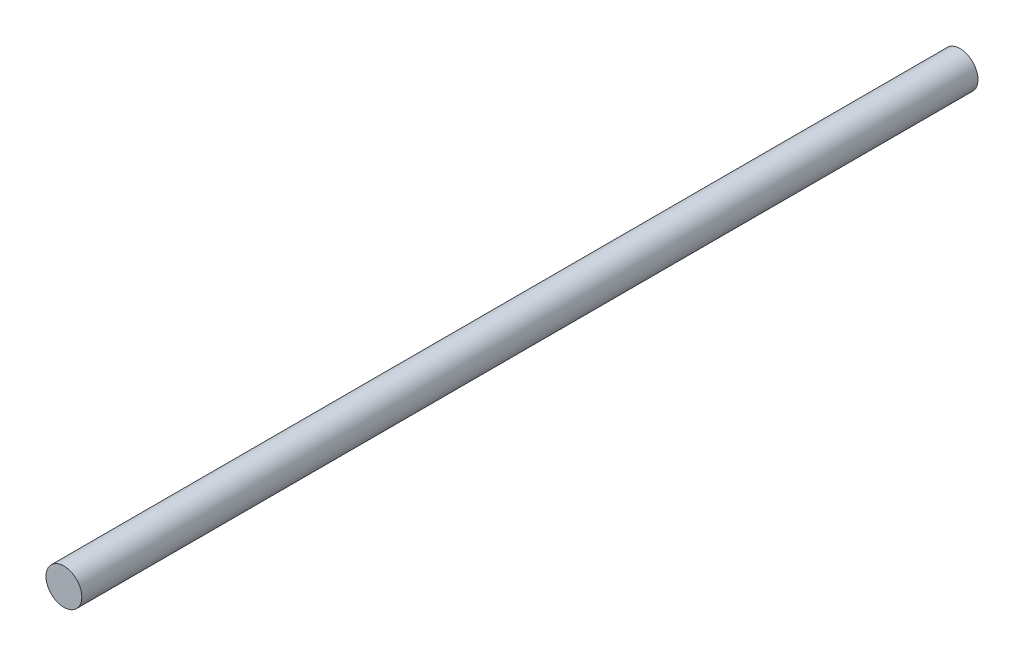
ISO-10303-21;
HEADER;
FILE_DESCRIPTION(('STEP AP214'),'2;1');
FILE_NAME('part.step','',(''),(''),'','','');
FILE_SCHEMA(('AUTOMOTIVE_DESIGN { 1 0 10303 214 1 1 1 1 }'));
ENDSEC;
DATA;
#1=APPLICATION_CONTEXT('core data for automotive mechanical design processes');
#2=APPLICATION_PROTOCOL_DEFINITION('international standard','automotive_design',2000,#1);
#3=PRODUCT_CONTEXT('',#1,'mechanical');
#4=PRODUCT('Part','Part','',(#3));
#5=PRODUCT_RELATED_PRODUCT_CATEGORY('part','',(#4));
#6=PRODUCT_DEFINITION_FORMATION('','',#4);
#7=PRODUCT_DEFINITION_CONTEXT('part definition',#1,'design');
#8=PRODUCT_DEFINITION('design','',#6,#7);
#9=PRODUCT_DEFINITION_SHAPE('','',#8);
#10=(LENGTH_UNIT() NAMED_UNIT(*) SI_UNIT(.MILLI.,.METRE.));
#11=(NAMED_UNIT(*) PLANE_ANGLE_UNIT() SI_UNIT($,.RADIAN.));
#12=(NAMED_UNIT(*) SI_UNIT($,.STERADIAN.) SOLID_ANGLE_UNIT());
#13=UNCERTAINTY_MEASURE_WITH_UNIT(LENGTH_MEASURE(1.E-05),#10,'distance_accuracy_value','');
#14=(GEOMETRIC_REPRESENTATION_CONTEXT(3) GLOBAL_UNCERTAINTY_ASSIGNED_CONTEXT((#13)) GLOBAL_UNIT_ASSIGNED_CONTEXT((#10,
#11,#12)) REPRESENTATION_CONTEXT('',''));
#15=CARTESIAN_POINT('',(0.,0.,0.));
#16=DIRECTION('',(0.,0.,1.));
#17=DIRECTION('',(1.,0.,0.));
#18=AXIS2_PLACEMENT_3D('',#15,#16,#17);
#19=CARTESIAN_POINT('',(0.,0.,100.));
#20=DIRECTION('',(0.,0.,-1.));
#21=DIRECTION('',(-1.,0.,0.));
#22=AXIS2_PLACEMENT_3D('',#19,#20,#21);
#23=CYLINDRICAL_SURFACE('',#22,4.);
#24=CARTESIAN_POINT('',(0.,0.,100.));
#25=DIRECTION('',(0.,0.,1.));
#26=DIRECTION('',(1.,0.,0.));
#27=AXIS2_PLACEMENT_3D('',#24,#25,#26);
#28=CIRCLE('',#27,4.);
#29=CARTESIAN_POINT('',(4.,0.,100.));
#30=VERTEX_POINT('',#29);
#31=EDGE_CURVE('E10',#30,#30,#28,.T.);
#32=ORIENTED_EDGE('',*,*,#31,.F.);
#33=EDGE_LOOP('',(#32));
#34=FACE_BOUND('',#33,.T.);
#35=CARTESIAN_POINT('',(0.,0.,-100.));
#36=DIRECTION('',(0.,0.,1.));
#37=DIRECTION('',(1.,0.,0.));
#38=AXIS2_PLACEMENT_3D('',#35,#36,#37);
#39=CIRCLE('',#38,4.);
#40=CARTESIAN_POINT('',(4.,0.,-100.));
#41=VERTEX_POINT('',#40);
#42=EDGE_CURVE('E36',#41,#41,#39,.T.);
#43=ORIENTED_EDGE('',*,*,#42,.T.);
#44=EDGE_LOOP('',(#43));
#45=FACE_BOUND('',#44,.T.);
#46=ADVANCED_FACE('F33',(#34,#45),#23,.T.);
#47=CARTESIAN_POINT('',(0.,0.,100.));
#48=DIRECTION('',(0.,0.,1.));
#49=DIRECTION('',(1.,0.,0.));
#50=AXIS2_PLACEMENT_3D('',#47,#48,#49);
#51=PLANE('',#50);
#52=ORIENTED_EDGE('',*,*,#31,.T.);
#53=EDGE_LOOP('',(#52));
#54=FACE_BOUND('',#53,.T.);
#55=ADVANCED_FACE('F48',(#54),#51,.T.);
#56=CARTESIAN_POINT('',(0.,0.,-100.));
#57=DIRECTION('',(0.,0.,1.));
#58=DIRECTION('',(1.,0.,0.));
#59=AXIS2_PLACEMENT_3D('',#56,#57,#58);
#60=PLANE('',#59);
#61=ORIENTED_EDGE('',*,*,#42,.F.);
#62=EDGE_LOOP('',(#61));
#63=FACE_BOUND('',#62,.T.);
#64=ADVANCED_FACE('F46',(#63),#60,.F.);
#65=CLOSED_SHELL('',(#46,#55,#64));
#66=MANIFOLD_SOLID_BREP('B2',#65);
#67=ADVANCED_BREP_SHAPE_REPRESENTATION('',(#18,#66),#14);
#68=SHAPE_DEFINITION_REPRESENTATION(#9,#67);
ENDSEC;
END-ISO-10303-21;
